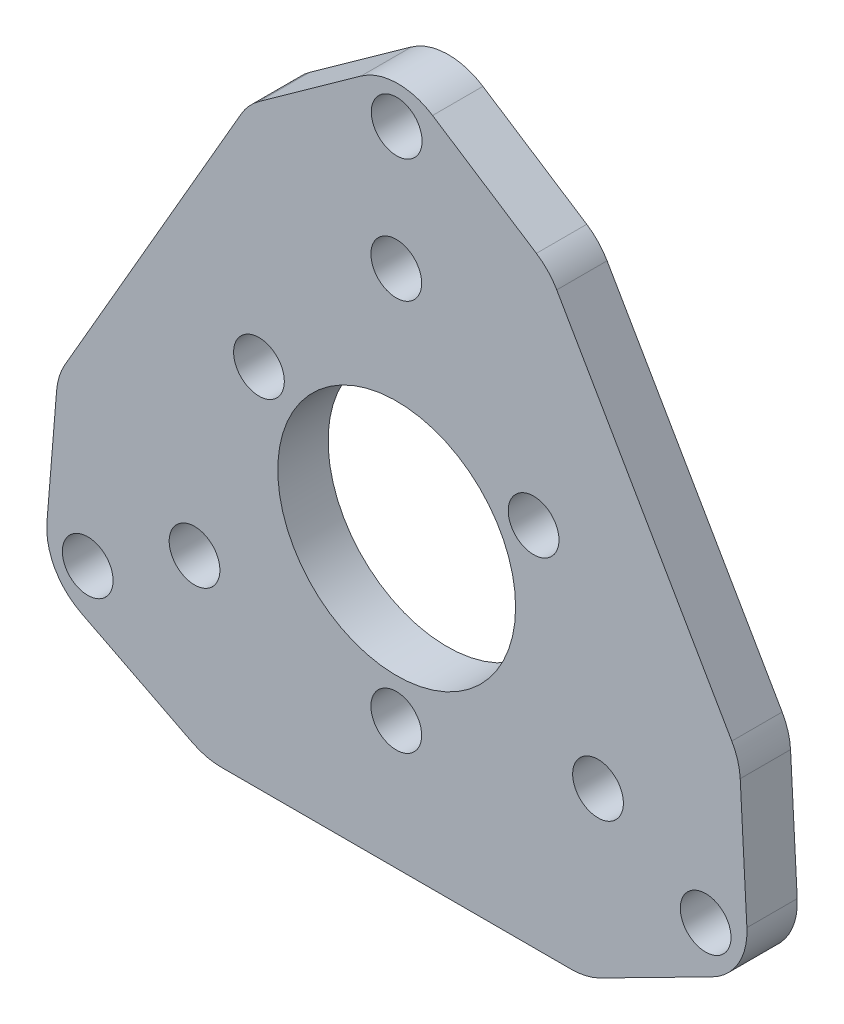
ISO-10303-21;
HEADER;
FILE_DESCRIPTION(('STEP AP214'),'2;1');
FILE_NAME('part.step','',(''),(''),'','','');
FILE_SCHEMA(('AUTOMOTIVE_DESIGN { 1 0 10303 214 1 1 1 1 }'));
ENDSEC;
DATA;
#1=APPLICATION_CONTEXT('core data for automotive mechanical design processes');
#2=APPLICATION_PROTOCOL_DEFINITION('international standard','automotive_design',2000,#1);
#3=PRODUCT_CONTEXT('',#1,'mechanical');
#4=PRODUCT('Part','Part','',(#3));
#5=PRODUCT_RELATED_PRODUCT_CATEGORY('part','',(#4));
#6=PRODUCT_DEFINITION_FORMATION('','',#4);
#7=PRODUCT_DEFINITION_CONTEXT('part definition',#1,'design');
#8=PRODUCT_DEFINITION('design','',#6,#7);
#9=PRODUCT_DEFINITION_SHAPE('','',#8);
#10=(LENGTH_UNIT() NAMED_UNIT(*) SI_UNIT(.MILLI.,.METRE.));
#11=(NAMED_UNIT(*) PLANE_ANGLE_UNIT() SI_UNIT($,.RADIAN.));
#12=(NAMED_UNIT(*) SI_UNIT($,.STERADIAN.) SOLID_ANGLE_UNIT());
#13=UNCERTAINTY_MEASURE_WITH_UNIT(LENGTH_MEASURE(1.E-05),#10,'distance_accuracy_value','');
#14=(GEOMETRIC_REPRESENTATION_CONTEXT(3) GLOBAL_UNCERTAINTY_ASSIGNED_CONTEXT((#13)) GLOBAL_UNIT_ASSIGNED_CONTEXT((#10,
#11,#12)) REPRESENTATION_CONTEXT('',''));
#15=CARTESIAN_POINT('',(0.,0.,0.));
#16=DIRECTION('',(0.,0.,1.));
#17=DIRECTION('',(1.,0.,0.));
#18=AXIS2_PLACEMENT_3D('',#15,#16,#17);
#19=CARTESIAN_POINT('',(24.2268431001887,37.2525078239316,3.175));
#20=DIRECTION('',(-0.545189451040315,-0.838312866699754,0.));
#21=DIRECTION('',(0.838312866699754,-0.545189451040315,0.));
#22=AXIS2_PLACEMENT_3D('',#19,#20,#21);
#23=PLANE('',#22);
#24=DIRECTION('',(-0.838312866699754,0.545189451040315,0.));
#25=VECTOR('',#24,1.);
#26=CARTESIAN_POINT('',(24.2268431001887,37.2525078239316,0.));
#27=LINE('',#26,#25);
#28=CARTESIAN_POINT('',(31.086717457556,32.7912484497055,0.));
#29=VERTEX_POINT('',#28);
#30=CARTESIAN_POINT('',(24.5392106724059,37.049362301556,0.));
#31=VERTEX_POINT('',#30);
#32=EDGE_CURVE('E216',#29,#31,#27,.T.);
#33=ORIENTED_EDGE('',*,*,#32,.T.);
#34=DIRECTION('',(0.,0.,-1.));
#35=VECTOR('',#34,1.);
#36=CARTESIAN_POINT('',(24.5392106724059,37.049362301556,3.175));
#37=LINE('',#36,#35);
#38=CARTESIAN_POINT('',(24.5392106724059,37.049362301556,3.175));
#39=VERTEX_POINT('',#38);
#40=EDGE_CURVE('E11',#39,#31,#37,.T.);
#41=ORIENTED_EDGE('',*,*,#40,.F.);
#42=DIRECTION('',(-0.838312866699754,0.545189451040315,0.));
#43=VECTOR('',#42,1.);
#44=CARTESIAN_POINT('',(24.2268431001887,37.2525078239316,3.175));
#45=LINE('',#44,#43);
#46=CARTESIAN_POINT('',(31.086717457556,32.7912484497055,3.175));
#47=VERTEX_POINT('',#46);
#48=EDGE_CURVE('E315',#47,#39,#45,.T.);
#49=ORIENTED_EDGE('',*,*,#48,.F.);
#50=DIRECTION('',(0.,0.,-1.));
#51=VECTOR('',#50,1.);
#52=CARTESIAN_POINT('',(31.086717457556,32.7912484497055,3.175));
#53=LINE('',#52,#51);
#54=EDGE_CURVE('E54',#47,#29,#53,.T.);
#55=ORIENTED_EDGE('',*,*,#54,.T.);
#56=EDGE_LOOP('',(#33,#41,#49,#55));
#57=FACE_BOUND('',#56,.T.);
#58=ADVANCED_FACE('F37',(#57),#23,.F.);
#59=CARTESIAN_POINT('',(22.3584528682446,33.696110834757,3.175));
#60=DIRECTION('',(0.,0.,-1.));
#61=DIRECTION('',(-1.,0.,0.));
#62=AXIS2_PLACEMENT_3D('',#59,#60,#61);
#63=CYLINDRICAL_SURFACE('',#62,4.);
#64=CARTESIAN_POINT('',(22.3584528682446,33.696110834757,0.));
#65=DIRECTION('',(0.,0.,1.));
#66=DIRECTION('',(1.,0.,0.));
#67=AXIS2_PLACEMENT_3D('',#64,#65,#66);
#68=CIRCLE('',#67,4.);
#69=CARTESIAN_POINT('',(20.0297433145625,36.9483580293272,0.));
#70=VERTEX_POINT('',#69);
#71=EDGE_CURVE('E218',#31,#70,#68,.T.);
#72=ORIENTED_EDGE('',*,*,#71,.T.);
#73=DIRECTION('',(0.,0.,-1.));
#74=VECTOR('',#73,1.);
#75=CARTESIAN_POINT('',(20.0297433145625,36.9483580293272,3.175));
#76=LINE('',#75,#74);
#77=CARTESIAN_POINT('',(20.0297433145625,36.9483580293272,3.175));
#78=VERTEX_POINT('',#77);
#79=EDGE_CURVE('E46',#78,#70,#76,.T.);
#80=ORIENTED_EDGE('',*,*,#79,.F.);
#81=CARTESIAN_POINT('',(22.3584528682446,33.696110834757,3.175));
#82=DIRECTION('',(0.,0.,1.));
#83=DIRECTION('',(1.,0.,0.));
#84=AXIS2_PLACEMENT_3D('',#81,#82,#83);
#85=CIRCLE('',#84,4.);
#86=EDGE_CURVE('E123',#39,#78,#85,.T.);
#87=ORIENTED_EDGE('',*,*,#86,.F.);
#88=ORIENTED_EDGE('',*,*,#40,.T.);
#89=EDGE_LOOP('',(#72,#80,#87,#88));
#90=FACE_BOUND('',#89,.T.);
#91=ADVANCED_FACE('F299',(#90),#63,.T.);
#92=CARTESIAN_POINT('',(-10.7006735197726,14.9444293641794,3.175));
#93=DIRECTION('',(-0.582177388420527,0.813061798642548,0.));
#94=DIRECTION('',(-0.813061798642548,-0.582177388420527,0.));
#95=AXIS2_PLACEMENT_3D('',#92,#93,#94);
#96=PLANE('',#95);
#97=DIRECTION('',(0.813061798642548,0.582177388420527,0.));
#98=VECTOR('',#97,1.);
#99=CARTESIAN_POINT('',(-10.7006735197726,14.9444293641794,0.));
#100=LINE('',#99,#98);
#101=CARTESIAN_POINT('',(13.6028361277302,32.3464937578807,0.));
#102=VERTEX_POINT('',#101);
#103=EDGE_CURVE('E221',#102,#70,#100,.T.);
#104=ORIENTED_EDGE('',*,*,#103,.F.);
#105=DIRECTION('',(0.,0.,-1.));
#106=VECTOR('',#105,1.);
#107=CARTESIAN_POINT('',(13.6028361277302,32.3464937578807,3.175));
#108=LINE('',#107,#106);
#109=CARTESIAN_POINT('',(13.6028361277302,32.3464937578807,3.175));
#110=VERTEX_POINT('',#109);
#111=EDGE_CURVE('E292',#110,#102,#108,.T.);
#112=ORIENTED_EDGE('',*,*,#111,.F.);
#113=DIRECTION('',(0.813061798642548,0.582177388420527,0.));
#114=VECTOR('',#113,1.);
#115=CARTESIAN_POINT('',(-10.7006735197726,14.9444293641794,3.175));
#116=LINE('',#115,#114);
#117=EDGE_CURVE('E298',#110,#78,#116,.T.);
#118=ORIENTED_EDGE('',*,*,#117,.T.);
#119=ORIENTED_EDGE('',*,*,#79,.T.);
#120=EDGE_LOOP('',(#104,#112,#118,#119));
#121=FACE_BOUND('',#120,.T.);
#122=ADVANCED_FACE('F296',(#121),#96,.T.);
#123=CARTESIAN_POINT('',(15.9315456814123,29.0942465633105,3.175));
#124=DIRECTION('',(0.,0.,-1.));
#125=DIRECTION('',(-1.,0.,0.));
#126=AXIS2_PLACEMENT_3D('',#123,#124,#125);
#127=CYLINDRICAL_SURFACE('',#126,4.);
#128=CARTESIAN_POINT('',(15.9315456814123,29.0942465633105,0.));
#129=DIRECTION('',(0.,0.,1.));
#130=DIRECTION('',(1.,0.,0.));
#131=AXIS2_PLACEMENT_3D('',#128,#129,#130);
#132=CIRCLE('',#131,4.);
#133=CARTESIAN_POINT('',(12.4674440662746,31.0942465633105,0.));
#134=VERTEX_POINT('',#133);
#135=EDGE_CURVE('E224',#134,#102,#132,.F.);
#136=ORIENTED_EDGE('',*,*,#135,.F.);
#137=DIRECTION('',(0.,0.,-1.));
#138=VECTOR('',#137,1.);
#139=CARTESIAN_POINT('',(12.4674440662746,31.0942465633105,3.175));
#140=LINE('',#139,#138);
#141=CARTESIAN_POINT('',(12.4674440662746,31.0942465633105,3.175));
#142=VERTEX_POINT('',#141);
#143=EDGE_CURVE('E290',#142,#134,#140,.T.);
#144=ORIENTED_EDGE('',*,*,#143,.F.);
#145=CARTESIAN_POINT('',(15.9315456814123,29.0942465633105,3.175));
#146=DIRECTION('',(0.,0.,1.));
#147=DIRECTION('',(1.,0.,0.));
#148=AXIS2_PLACEMENT_3D('',#145,#146,#147);
#149=CIRCLE('',#148,4.);
#150=EDGE_CURVE('E309',#142,#110,#149,.F.);
#151=ORIENTED_EDGE('',*,*,#150,.T.);
#152=ORIENTED_EDGE('',*,*,#111,.T.);
#153=EDGE_LOOP('',(#136,#144,#151,#152));
#154=FACE_BOUND('',#153,.T.);
#155=ADVANCED_FACE('F306',(#154),#127,.T.);
#156=CARTESIAN_POINT('',(-4.11362066797595,2.37499999999991,3.175));
#157=DIRECTION('',(-0.86602540378444,0.499999999999998,0.));
#158=DIRECTION('',(-0.499999999999998,-0.86602540378444,0.));
#159=AXIS2_PLACEMENT_3D('',#156,#157,#158);
#160=PLANE('',#159);
#161=DIRECTION('',(0.499999999999998,0.86602540378444,0.));
#162=VECTOR('',#161,1.);
#163=CARTESIAN_POINT('',(-4.11362066797595,2.37499999999991,0.));
#164=LINE('',#163,#162);
#165=CARTESIAN_POINT('',(1.34956059393549,11.8375075165888,0.));
#166=VERTEX_POINT('',#165);
#167=EDGE_CURVE('E227',#166,#134,#164,.T.);
#168=ORIENTED_EDGE('',*,*,#167,.F.);
#169=DIRECTION('',(0.,0.,-1.));
#170=VECTOR('',#169,1.);
#171=CARTESIAN_POINT('',(1.34956059393549,11.8375075165888,3.175));
#172=LINE('',#171,#170);
#173=CARTESIAN_POINT('',(1.34956059393549,11.8375075165888,3.175));
#174=VERTEX_POINT('',#173);
#175=EDGE_CURVE('E288',#174,#166,#172,.T.);
#176=ORIENTED_EDGE('',*,*,#175,.F.);
#177=DIRECTION('',(0.499999999999998,0.86602540378444,0.));
#178=VECTOR('',#177,1.);
#179=CARTESIAN_POINT('',(-4.11362066797595,2.37499999999991,3.175));
#180=LINE('',#179,#178);
#181=EDGE_CURVE('E313',#174,#142,#180,.T.);
#182=ORIENTED_EDGE('',*,*,#181,.T.);
#183=ORIENTED_EDGE('',*,*,#143,.T.);
#184=EDGE_LOOP('',(#168,#176,#182,#183));
#185=FACE_BOUND('',#184,.T.);
#186=ADVANCED_FACE('F689',(#185),#160,.T.);
#187=CARTESIAN_POINT('',(4.81366220907325,9.83750751658883,3.175));
#188=DIRECTION('',(0.,0.,-1.));
#189=DIRECTION('',(-1.,0.,0.));
#190=AXIS2_PLACEMENT_3D('',#187,#188,#189);
#191=CYLINDRICAL_SURFACE('',#190,4.);
#192=CARTESIAN_POINT('',(4.81366220907325,9.83750751658883,0.));
#193=DIRECTION('',(0.,0.,1.));
#194=DIRECTION('',(1.,0.,0.));
#195=AXIS2_PLACEMENT_3D('',#192,#193,#194);
#196=CIRCLE('',#195,4.);
#197=CARTESIAN_POINT('',(0.82683782126869,10.1619012600655,0.));
#198=VERTEX_POINT('',#197);
#199=EDGE_CURVE('E230',#198,#166,#196,.F.);
#200=ORIENTED_EDGE('',*,*,#199,.F.);
#201=DIRECTION('',(0.,0.,-1.));
#202=VECTOR('',#201,1.);
#203=CARTESIAN_POINT('',(0.82683782126869,10.1619012600655,3.175));
#204=LINE('',#203,#202);
#205=CARTESIAN_POINT('',(0.82683782126869,10.1619012600655,3.175));
#206=VERTEX_POINT('',#205);
#207=EDGE_CURVE('E286',#206,#198,#204,.T.);
#208=ORIENTED_EDGE('',*,*,#207,.F.);
#209=CARTESIAN_POINT('',(4.81366220907325,9.83750751658883,3.175));
#210=DIRECTION('',(0.,0.,1.));
#211=DIRECTION('',(1.,0.,0.));
#212=AXIS2_PLACEMENT_3D('',#209,#210,#211);
#213=CIRCLE('',#212,4.);
#214=EDGE_CURVE('E320',#206,#174,#213,.F.);
#215=ORIENTED_EDGE('',*,*,#214,.T.);
#216=ORIENTED_EDGE('',*,*,#175,.T.);
#217=EDGE_LOOP('',(#200,#208,#215,#216));
#218=FACE_BOUND('',#217,.T.);
#219=ADVANCED_FACE('F680',(#218),#191,.T.);
#220=CARTESIAN_POINT('',(0.,0.,3.175));
#221=DIRECTION('',(0.996706096951139,-0.0810984358691737,0.));
#222=DIRECTION('',(0.0810984358691737,0.996706096951139,0.));
#223=AXIS2_PLACEMENT_3D('',#220,#221,#222);
#224=PLANE('',#223);
#225=DIRECTION('',(-0.0810984358691737,-0.996706096951139,0.));
#226=VECTOR('',#225,1.);
#227=CARTESIAN_POINT('',(0.,0.,0.));
#228=LINE('',#227,#226);
#229=CARTESIAN_POINT('',(0.217529034956228,2.67344879196595,0.));
#230=VERTEX_POINT('',#229);
#231=EDGE_CURVE('E233',#198,#230,#228,.T.);
#232=ORIENTED_EDGE('',*,*,#231,.T.);
#233=DIRECTION('',(0.,0.,-1.));
#234=VECTOR('',#233,1.);
#235=CARTESIAN_POINT('',(0.217529034956228,2.67344879196595,3.175));
#236=LINE('',#235,#234);
#237=CARTESIAN_POINT('',(0.217529034956228,2.67344879196595,3.175));
#238=VERTEX_POINT('',#237);
#239=EDGE_CURVE('E284',#238,#230,#236,.T.);
#240=ORIENTED_EDGE('',*,*,#239,.F.);
#241=DIRECTION('',(-0.0810984358691737,-0.996706096951139,0.));
#242=VECTOR('',#241,1.);
#243=CARTESIAN_POINT('',(0.,0.,3.175));
#244=LINE('',#243,#242);
#245=EDGE_CURVE('E323',#206,#238,#244,.T.);
#246=ORIENTED_EDGE('',*,*,#245,.F.);
#247=ORIENTED_EDGE('',*,*,#207,.T.);
#248=EDGE_LOOP('',(#232,#240,#246,#247));
#249=FACE_BOUND('',#248,.T.);
#250=ADVANCED_FACE('F671',(#249),#224,.F.);
#251=CARTESIAN_POINT('',(4.20435342276078,2.34905504848923,3.175));
#252=DIRECTION('',(0.,0.,-1.));
#253=DIRECTION('',(-1.,0.,0.));
#254=AXIS2_PLACEMENT_3D('',#251,#252,#253);
#255=CYLINDRICAL_SURFACE('',#254,3.99999999999999);
#256=CARTESIAN_POINT('',(4.20435342276078,2.34905504848923,0.));
#257=DIRECTION('',(0.,0.,1.));
#258=DIRECTION('',(1.,0.,0.));
#259=AXIS2_PLACEMENT_3D('',#256,#257,#258);
#260=CIRCLE('',#259,3.99999999999999);
#261=CARTESIAN_POINT('',(2.39073136931604,-1.21616234281508,0.));
#262=VERTEX_POINT('',#261);
#263=EDGE_CURVE('E236',#262,#230,#260,.F.);
#264=ORIENTED_EDGE('',*,*,#263,.F.);
#265=DIRECTION('',(0.,0.,-1.));
#266=VECTOR('',#265,1.);
#267=CARTESIAN_POINT('',(2.39073136931604,-1.21616234281508,3.175));
#268=LINE('',#267,#266);
#269=CARTESIAN_POINT('',(2.39073136931604,-1.21616234281508,3.175));
#270=VERTEX_POINT('',#269);
#271=EDGE_CURVE('E282',#270,#262,#268,.T.);
#272=ORIENTED_EDGE('',*,*,#271,.F.);
#273=CARTESIAN_POINT('',(4.20435342276078,2.34905504848923,3.175));
#274=DIRECTION('',(0.,0.,1.));
#275=DIRECTION('',(1.,0.,0.));
#276=AXIS2_PLACEMENT_3D('',#273,#274,#275);
#277=CIRCLE('',#276,3.99999999999999);
#278=EDGE_CURVE('E325',#270,#238,#277,.F.);
#279=ORIENTED_EDGE('',*,*,#278,.T.);
#280=ORIENTED_EDGE('',*,*,#239,.T.);
#281=EDGE_LOOP('',(#264,#272,#279,#280));
#282=FACE_BOUND('',#281,.T.);
#283=ADVANCED_FACE('F662',(#282),#255,.T.);
#284=CARTESIAN_POINT('',(0.,0.,3.175));
#285=DIRECTION('',(0.453405513361187,0.891304347826082,0.));
#286=DIRECTION('',(-0.891304347826083,0.453405513361187,0.));
#287=AXIS2_PLACEMENT_3D('',#284,#285,#286);
#288=PLANE('',#287);
#289=DIRECTION('',(0.891304347826083,-0.453405513361187,0.));
#290=VECTOR('',#289,1.);
#291=CARTESIAN_POINT('',(0.,0.,0.));
#292=LINE('',#291,#290);
#293=CARTESIAN_POINT('',(9.39530454952662,-4.7793807949583,0.));
#294=VERTEX_POINT('',#293);
#295=EDGE_CURVE('E239',#262,#294,#292,.T.);
#296=ORIENTED_EDGE('',*,*,#295,.T.);
#297=DIRECTION('',(0.,0.,-1.));
#298=VECTOR('',#297,1.);
#299=CARTESIAN_POINT('',(9.39530454952662,-4.7793807949583,3.175));
#300=LINE('',#299,#298);
#301=CARTESIAN_POINT('',(9.39530454952662,-4.7793807949583,3.175));
#302=VERTEX_POINT('',#301);
#303=EDGE_CURVE('E280',#302,#294,#300,.T.);
#304=ORIENTED_EDGE('',*,*,#303,.F.);
#305=DIRECTION('',(0.891304347826083,-0.453405513361187,0.));
#306=VECTOR('',#305,1.);
#307=CARTESIAN_POINT('',(0.,0.,3.175));
#308=LINE('',#307,#306);
#309=EDGE_CURVE('E328',#270,#302,#308,.T.);
#310=ORIENTED_EDGE('',*,*,#309,.F.);
#311=ORIENTED_EDGE('',*,*,#271,.T.);
#312=EDGE_LOOP('',(#296,#304,#310,#311));
#313=FACE_BOUND('',#312,.T.);
#314=ADVANCED_FACE('F653',(#313),#288,.F.);
#315=CARTESIAN_POINT('',(11.2089266029714,-1.21416340365397,3.175));
#316=DIRECTION('',(0.,0.,-1.));
#317=DIRECTION('',(-1.,0.,0.));
#318=AXIS2_PLACEMENT_3D('',#315,#316,#317);
#319=CYLINDRICAL_SURFACE('',#318,4.);
#320=CARTESIAN_POINT('',(11.2089266029714,-1.21416340365397,0.));
#321=DIRECTION('',(0.,0.,1.));
#322=DIRECTION('',(1.,0.,0.));
#323=AXIS2_PLACEMENT_3D('',#320,#321,#322);
#324=CIRCLE('',#323,4.);
#325=CARTESIAN_POINT('',(11.2089266029714,-5.21416340365397,0.));
#326=VERTEX_POINT('',#325);
#327=EDGE_CURVE('E242',#326,#294,#324,.F.);
#328=ORIENTED_EDGE('',*,*,#327,.F.);
#329=DIRECTION('',(0.,0.,-1.));
#330=VECTOR('',#329,1.);
#331=CARTESIAN_POINT('',(11.2089266029714,-5.21416340365397,3.175));
#332=LINE('',#331,#330);
#333=CARTESIAN_POINT('',(11.2089266029714,-5.21416340365397,3.175));
#334=VERTEX_POINT('',#333);
#335=EDGE_CURVE('E278',#334,#326,#332,.T.);
#336=ORIENTED_EDGE('',*,*,#335,.F.);
#337=CARTESIAN_POINT('',(11.2089266029714,-1.21416340365397,3.175));
#338=DIRECTION('',(0.,0.,1.));
#339=DIRECTION('',(1.,0.,0.));
#340=AXIS2_PLACEMENT_3D('',#337,#338,#339);
#341=CIRCLE('',#340,4.);
#342=EDGE_CURVE('E330',#334,#302,#341,.F.);
#343=ORIENTED_EDGE('',*,*,#342,.T.);
#344=ORIENTED_EDGE('',*,*,#303,.T.);
#345=EDGE_LOOP('',(#328,#336,#343,#344));
#346=FACE_BOUND('',#345,.T.);
#347=ADVANCED_FACE('F644',(#346),#319,.T.);
#348=CARTESIAN_POINT('',(0.,-5.21416340365397,3.175));
#349=DIRECTION('',(0.,1.,0.));
#350=DIRECTION('',(-1.,0.,0.));
#351=AXIS2_PLACEMENT_3D('',#348,#349,#350);
#352=PLANE('',#351);
#353=DIRECTION('',(1.,0.,0.));
#354=VECTOR('',#353,1.);
#355=CARTESIAN_POINT('',(0.,-5.21416340365397,0.));
#356=LINE('',#355,#354);
#357=CARTESIAN_POINT('',(33.2910733970292,-5.21416340365397,0.));
#358=VERTEX_POINT('',#357);
#359=EDGE_CURVE('E245',#326,#358,#356,.T.);
#360=ORIENTED_EDGE('',*,*,#359,.T.);
#361=DIRECTION('',(0.,0.,-1.));
#362=VECTOR('',#361,1.);
#363=CARTESIAN_POINT('',(33.2910733970292,-5.21416340365397,3.175));
#364=LINE('',#363,#362);
#365=CARTESIAN_POINT('',(33.2910733970292,-5.21416340365397,3.175));
#366=VERTEX_POINT('',#365);
#367=EDGE_CURVE('E276',#366,#358,#364,.T.);
#368=ORIENTED_EDGE('',*,*,#367,.F.);
#369=DIRECTION('',(1.,0.,0.));
#370=VECTOR('',#369,1.);
#371=CARTESIAN_POINT('',(0.,-5.21416340365397,3.175));
#372=LINE('',#371,#370);
#373=EDGE_CURVE('E333',#334,#366,#372,.T.);
#374=ORIENTED_EDGE('',*,*,#373,.F.);
#375=ORIENTED_EDGE('',*,*,#335,.T.);
#376=EDGE_LOOP('',(#360,#368,#374,#375));
#377=FACE_BOUND('',#376,.T.);
#378=ADVANCED_FACE('F635',(#377),#352,.F.);
#379=CARTESIAN_POINT('',(33.2910733970292,-1.21416340365397,3.175));
#380=DIRECTION('',(0.,0.,-1.));
#381=DIRECTION('',(-1.,0.,0.));
#382=AXIS2_PLACEMENT_3D('',#379,#380,#381);
#383=CYLINDRICAL_SURFACE('',#382,4.);
#384=CARTESIAN_POINT('',(33.2910733970292,-1.21416340365397,0.));
#385=DIRECTION('',(0.,0.,1.));
#386=DIRECTION('',(1.,0.,0.));
#387=AXIS2_PLACEMENT_3D('',#384,#385,#386);
#388=CIRCLE('',#387,4.);
#389=CARTESIAN_POINT('',(35.104695450474,-4.77938079495826,0.));
#390=VERTEX_POINT('',#389);
#391=EDGE_CURVE('E248',#390,#358,#388,.F.);
#392=ORIENTED_EDGE('',*,*,#391,.F.);
#393=DIRECTION('',(0.,0.,-1.));
#394=VECTOR('',#393,1.);
#395=CARTESIAN_POINT('',(35.104695450474,-4.77938079495826,3.175));
#396=LINE('',#395,#394);
#397=CARTESIAN_POINT('',(35.104695450474,-4.77938079495826,3.175));
#398=VERTEX_POINT('',#397);
#399=EDGE_CURVE('E274',#398,#390,#396,.T.);
#400=ORIENTED_EDGE('',*,*,#399,.F.);
#401=CARTESIAN_POINT('',(33.2910733970292,-1.21416340365397,3.175));
#402=DIRECTION('',(0.,0.,1.));
#403=DIRECTION('',(1.,0.,0.));
#404=AXIS2_PLACEMENT_3D('',#401,#402,#403);
#405=CIRCLE('',#404,4.);
#406=EDGE_CURVE('E335',#398,#366,#405,.F.);
#407=ORIENTED_EDGE('',*,*,#406,.T.);
#408=ORIENTED_EDGE('',*,*,#367,.T.);
#409=EDGE_LOOP('',(#392,#400,#407,#408));
#410=FACE_BOUND('',#409,.T.);
#411=ADVANCED_FACE('F627',(#410),#383,.T.);
#412=CARTESIAN_POINT('',(9.14815689981217,-17.9834425897285,3.175));
#413=DIRECTION('',(-0.453405513361208,0.891304347826072,0.));
#414=DIRECTION('',(-0.891304347826072,-0.453405513361208,0.));
#415=AXIS2_PLACEMENT_3D('',#412,#413,#414);
#416=PLANE('',#415);
#417=DIRECTION('',(0.891304347826072,0.453405513361208,0.));
#418=VECTOR('',#417,1.);
#419=CARTESIAN_POINT('',(9.14815689981217,-17.9834425897285,0.));
#420=LINE('',#419,#418);
#421=CARTESIAN_POINT('',(42.1813920081454,-1.17947326229733,0.));
#422=VERTEX_POINT('',#421);
#423=EDGE_CURVE('E251',#390,#422,#420,.T.);
#424=ORIENTED_EDGE('',*,*,#423,.T.);
#425=DIRECTION('',(0.,0.,-1.));
#426=VECTOR('',#425,1.);
#427=CARTESIAN_POINT('',(42.1813920081454,-1.17947326229733,3.175));
#428=LINE('',#427,#426);
#429=CARTESIAN_POINT('',(42.1813920081454,-1.17947326229733,3.175));
#430=VERTEX_POINT('',#429);
#431=EDGE_CURVE('E272',#430,#422,#428,.T.);
#432=ORIENTED_EDGE('',*,*,#431,.F.);
#433=DIRECTION('',(0.891304347826072,0.453405513361208,0.));
#434=VECTOR('',#433,1.);
#435=CARTESIAN_POINT('',(9.14815689981217,-17.9834425897285,3.175));
#436=LINE('',#435,#434);
#437=EDGE_CURVE('E338',#398,#430,#436,.T.);
#438=ORIENTED_EDGE('',*,*,#437,.F.);
#439=ORIENTED_EDGE('',*,*,#399,.T.);
#440=EDGE_LOOP('',(#424,#432,#438,#439));
#441=FACE_BOUND('',#440,.T.);
#442=ADVANCED_FACE('F347',(#441),#416,.F.);
#443=CARTESIAN_POINT('',(40.3677699547006,2.385744129007,3.175));
#444=DIRECTION('',(0.,0.,-1.));
#445=DIRECTION('',(-1.,0.,0.));
#446=AXIS2_PLACEMENT_3D('',#443,#444,#445);
#447=CYLINDRICAL_SURFACE('',#446,4.00000000000002);
#448=CARTESIAN_POINT('',(40.3677699547006,2.385744129007,0.));
#449=DIRECTION('',(0.,0.,1.));
#450=DIRECTION('',(1.,0.,0.));
#451=AXIS2_PLACEMENT_3D('',#448,#449,#450);
#452=CIRCLE('',#451,4.00000000000002);
#453=CARTESIAN_POINT('',(44.3621498123066,2.59771005351232,0.));
#454=VERTEX_POINT('',#453);
#455=EDGE_CURVE('E254',#454,#422,#452,.F.);
#456=ORIENTED_EDGE('',*,*,#455,.F.);
#457=DIRECTION('',(0.,0.,-1.));
#458=VECTOR('',#457,1.);
#459=CARTESIAN_POINT('',(44.3621498123066,2.59771005351232,3.175));
#460=LINE('',#459,#458);
#461=CARTESIAN_POINT('',(44.3621498123066,2.59771005351232,3.175));
#462=VERTEX_POINT('',#461);
#463=EDGE_CURVE('E270',#462,#454,#460,.T.);
#464=ORIENTED_EDGE('',*,*,#463,.F.);
#465=CARTESIAN_POINT('',(40.3677699547006,2.385744129007,3.175));
#466=DIRECTION('',(0.,0.,1.));
#467=DIRECTION('',(1.,0.,0.));
#468=AXIS2_PLACEMENT_3D('',#465,#466,#467);
#469=CIRCLE('',#468,4.00000000000002);
#470=EDGE_CURVE('E192',#462,#430,#469,.F.);
#471=ORIENTED_EDGE('',*,*,#470,.T.);
#472=ORIENTED_EDGE('',*,*,#431,.T.);
#473=EDGE_LOOP('',(#456,#464,#471,#472));
#474=FACE_BOUND('',#473,.T.);
#475=ADVANCED_FACE('F342',(#474),#447,.T.);
#476=CARTESIAN_POINT('',(44.3750396802976,2.35480766629788,3.175));
#477=DIRECTION('',(-0.998594964401502,-0.0529914811263407,0.));
#478=DIRECTION('',(0.0529914811263407,-0.998594964401502,0.));
#479=AXIS2_PLACEMENT_3D('',#476,#477,#478);
#480=PLANE('',#479);
#481=DIRECTION('',(-0.0529914811263407,0.998594964401502,0.));
#482=VECTOR('',#481,1.);
#483=CARTESIAN_POINT('',(44.3750396802976,2.35480766629788,0.));
#484=LINE('',#483,#482);
#485=CARTESIAN_POINT('',(43.9414129080299,10.5262628136601,0.));
#486=VERTEX_POINT('',#485);
#487=EDGE_CURVE('E257',#454,#486,#484,.T.);
#488=ORIENTED_EDGE('',*,*,#487,.T.);
#489=DIRECTION('',(0.,0.,-1.));
#490=VECTOR('',#489,1.);
#491=CARTESIAN_POINT('',(43.9414129080299,10.5262628136601,3.175));
#492=LINE('',#491,#490);
#493=CARTESIAN_POINT('',(43.9414129080299,10.5262628136601,3.175));
#494=VERTEX_POINT('',#493);
#495=EDGE_CURVE('E178',#494,#486,#492,.T.);
#496=ORIENTED_EDGE('',*,*,#495,.F.);
#497=DIRECTION('',(-0.0529914811263407,0.998594964401502,0.));
#498=VECTOR('',#497,1.);
#499=CARTESIAN_POINT('',(44.3750396802976,2.35480766629788,3.175));
#500=LINE('',#499,#498);
#501=EDGE_CURVE('E189',#462,#494,#500,.T.);
#502=ORIENTED_EDGE('',*,*,#501,.F.);
#503=ORIENTED_EDGE('',*,*,#463,.T.);
#504=EDGE_LOOP('',(#488,#496,#502,#503));
#505=FACE_BOUND('',#504,.T.);
#506=ADVANCED_FACE('F352',(#505),#480,.F.);
#507=CARTESIAN_POINT('',(39.9470330504239,10.3142968891547,3.175));
#508=DIRECTION('',(0.,0.,-1.));
#509=DIRECTION('',(-1.,0.,0.));
#510=AXIS2_PLACEMENT_3D('',#507,#508,#509);
#511=CYLINDRICAL_SURFACE('',#510,4.);
#512=CARTESIAN_POINT('',(39.9470330504239,10.3142968891547,0.));
#513=DIRECTION('',(0.,0.,1.));
#514=DIRECTION('',(1.,0.,0.));
#515=AXIS2_PLACEMENT_3D('',#512,#513,#514);
#516=CIRCLE('',#515,4.);
#517=CARTESIAN_POINT('',(43.4111346655617,12.3142968891547,0.));
#518=VERTEX_POINT('',#517);
#519=EDGE_CURVE('E175',#518,#486,#516,.F.);
#520=ORIENTED_EDGE('',*,*,#519,.F.);
#521=DIRECTION('',(0.,0.,-1.));
#522=VECTOR('',#521,1.);
#523=CARTESIAN_POINT('',(43.4111346655617,12.3142968891547,3.175));
#524=LINE('',#523,#522);
#525=CARTESIAN_POINT('',(43.4111346655617,12.3142968891547,3.175));
#526=VERTEX_POINT('',#525);
#527=EDGE_CURVE('E169',#526,#518,#524,.T.);
#528=ORIENTED_EDGE('',*,*,#527,.F.);
#529=CARTESIAN_POINT('',(39.9470330504239,10.3142968891547,3.175));
#530=DIRECTION('',(0.,0.,1.));
#531=DIRECTION('',(1.,0.,0.));
#532=AXIS2_PLACEMENT_3D('',#529,#530,#531);
#533=CIRCLE('',#532,4.);
#534=EDGE_CURVE('E173',#526,#494,#533,.F.);
#535=ORIENTED_EDGE('',*,*,#534,.T.);
#536=ORIENTED_EDGE('',*,*,#495,.T.);
#537=EDGE_LOOP('',(#520,#528,#535,#536));
#538=FACE_BOUND('',#537,.T.);
#539=ADVANCED_FACE('F171',(#538),#511,.T.);
#540=CARTESIAN_POINT('',(37.8905979670472,21.8761469360304,3.175));
#541=DIRECTION('',(-0.86602540378444,-0.499999999999997,0.));
#542=DIRECTION('',(0.499999999999997,-0.86602540378444,0.));
#543=AXIS2_PLACEMENT_3D('',#540,#541,#542);
#544=PLANE('',#543);
#545=DIRECTION('',(-0.499999999999997,0.86602540378444,0.));
#546=VECTOR('',#545,1.);
#547=CARTESIAN_POINT('',(37.8905979670472,21.8761469360304,0.));
#548=LINE('',#547,#546);
#549=CARTESIAN_POINT('',(32.3700612685325,31.4379969829065,0.));
#550=VERTEX_POINT('',#549);
#551=EDGE_CURVE('E261',#518,#550,#548,.T.);
#552=ORIENTED_EDGE('',*,*,#551,.T.);
#553=DIRECTION('',(0.,0.,-1.));
#554=VECTOR('',#553,1.);
#555=CARTESIAN_POINT('',(32.3700612685325,31.4379969829065,3.175));
#556=LINE('',#555,#554);
#557=CARTESIAN_POINT('',(32.3700612685325,31.4379969829065,3.175));
#558=VERTEX_POINT('',#557);
#559=EDGE_CURVE('E111',#558,#550,#556,.T.);
#560=ORIENTED_EDGE('',*,*,#559,.F.);
#561=DIRECTION('',(-0.499999999999997,0.86602540378444,0.));
#562=VECTOR('',#561,1.);
#563=CARTESIAN_POINT('',(37.8905979670472,21.8761469360304,3.175));
#564=LINE('',#563,#562);
#565=EDGE_CURVE('E180',#526,#558,#564,.T.);
#566=ORIENTED_EDGE('',*,*,#565,.F.);
#567=ORIENTED_EDGE('',*,*,#527,.T.);
#568=EDGE_LOOP('',(#552,#560,#566,#567));
#569=FACE_BOUND('',#568,.T.);
#570=ADVANCED_FACE('F181',(#569),#544,.F.);
#571=CARTESIAN_POINT('',(13.5897459621547,17.8460434894692,3.175));
#572=DIRECTION('',(0.,0.,-1.));
#573=DIRECTION('',(-1.,0.,0.));
#574=AXIS2_PLACEMENT_3D('',#571,#572,#573);
#575=CYLINDRICAL_SURFACE('',#574,1.60000000000057);
#576=CARTESIAN_POINT('',(13.5897459621547,17.8460434894692,3.175));
#577=DIRECTION('',(0.,0.,1.));
#578=DIRECTION('',(1.,0.,0.));
#579=AXIS2_PLACEMENT_3D('',#576,#577,#578);
#580=CIRCLE('',#579,1.60000000000057);
#581=CARTESIAN_POINT('',(15.1897459621552,17.8460434894692,3.175));
#582=VERTEX_POINT('',#581);
#583=EDGE_CURVE('E561',#582,#582,#580,.T.);
#584=ORIENTED_EDGE('',*,*,#583,.T.);
#585=EDGE_LOOP('',(#584));
#586=FACE_BOUND('',#585,.T.);
#587=CARTESIAN_POINT('',(13.5897459621547,17.8460434894692,0.));
#588=DIRECTION('',(0.,0.,1.));
#589=DIRECTION('',(1.,0.,0.));
#590=AXIS2_PLACEMENT_3D('',#587,#588,#589);
#591=CIRCLE('',#590,1.60000000000057);
#592=CARTESIAN_POINT('',(15.1897459621552,17.8460434894692,0.));
#593=VERTEX_POINT('',#592);
#594=EDGE_CURVE('E213',#593,#593,#591,.T.);
#595=ORIENTED_EDGE('',*,*,#594,.F.);
#596=EDGE_LOOP('',(#595));
#597=FACE_BOUND('',#596,.T.);
#598=ADVANCED_FACE('F369',(#586,#597),#575,.F.);
#599=CARTESIAN_POINT('',(9.52627944163036,5.4999999999991,3.175));
#600=DIRECTION('',(0.,0.,-1.));
#601=DIRECTION('',(-1.,0.,0.));
#602=AXIS2_PLACEMENT_3D('',#599,#600,#601);
#603=CYLINDRICAL_SURFACE('',#602,1.59999999999933);
#604=CARTESIAN_POINT('',(9.52627944163036,5.4999999999991,3.175));
#605=DIRECTION('',(0.,0.,1.));
#606=DIRECTION('',(1.,0.,0.));
#607=AXIS2_PLACEMENT_3D('',#604,#605,#606);
#608=CIRCLE('',#607,1.59999999999933);
#609=CARTESIAN_POINT('',(11.1262794416297,5.4999999999991,3.175));
#610=VERTEX_POINT('',#609);
#611=EDGE_CURVE('E558',#610,#610,#608,.T.);
#612=ORIENTED_EDGE('',*,*,#611,.T.);
#613=EDGE_LOOP('',(#612));
#614=FACE_BOUND('',#613,.T.);
#615=CARTESIAN_POINT('',(9.52627944163036,5.4999999999991,0.));
#616=DIRECTION('',(0.,0.,1.));
#617=DIRECTION('',(1.,0.,0.));
#618=AXIS2_PLACEMENT_3D('',#615,#616,#617);
#619=CIRCLE('',#618,1.59999999999933);
#620=CARTESIAN_POINT('',(11.1262794416297,5.4999999999991,0.));
#621=VERTEX_POINT('',#620);
#622=EDGE_CURVE('E210',#621,#621,#619,.T.);
#623=ORIENTED_EDGE('',*,*,#622,.F.);
#624=EDGE_LOOP('',(#623));
#625=FACE_BOUND('',#624,.T.);
#626=ADVANCED_FACE('F372',(#614,#625),#603,.F.);
#627=CARTESIAN_POINT('',(34.9737205583721,5.50000000000108,3.175));
#628=DIRECTION('',(0.,0.,-1.));
#629=DIRECTION('',(-1.,0.,0.));
#630=AXIS2_PLACEMENT_3D('',#627,#628,#629);
#631=CYLINDRICAL_SURFACE('',#630,1.60000000000013);
#632=CARTESIAN_POINT('',(34.9737205583721,5.50000000000108,3.175));
#633=DIRECTION('',(0.,0.,1.));
#634=DIRECTION('',(1.,0.,0.));
#635=AXIS2_PLACEMENT_3D('',#632,#633,#634);
#636=CIRCLE('',#635,1.60000000000013);
#637=CARTESIAN_POINT('',(36.5737205583722,5.50000000000108,3.175));
#638=VERTEX_POINT('',#637);
#639=EDGE_CURVE('E555',#638,#638,#636,.T.);
#640=ORIENTED_EDGE('',*,*,#639,.T.);
#641=EDGE_LOOP('',(#640));
#642=FACE_BOUND('',#641,.T.);
#643=CARTESIAN_POINT('',(34.9737205583721,5.50000000000108,0.));
#644=DIRECTION('',(0.,0.,1.));
#645=DIRECTION('',(1.,0.,0.));
#646=AXIS2_PLACEMENT_3D('',#643,#644,#645);
#647=CIRCLE('',#646,1.60000000000013);
#648=CARTESIAN_POINT('',(36.5737205583722,5.50000000000108,0.));
#649=VERTEX_POINT('',#648);
#650=EDGE_CURVE('E207',#649,#649,#647,.T.);
#651=ORIENTED_EDGE('',*,*,#650,.F.);
#652=EDGE_LOOP('',(#651));
#653=FACE_BOUND('',#652,.T.);
#654=ADVANCED_FACE('F376',(#642,#653),#631,.F.);
#655=CARTESIAN_POINT('',(30.9102540378434,17.8460434894696,3.175));
#656=DIRECTION('',(0.,0.,-1.));
#657=DIRECTION('',(-1.,0.,0.));
#658=AXIS2_PLACEMENT_3D('',#655,#656,#657);
#659=CYLINDRICAL_SURFACE('',#658,1.60000000000058);
#660=CARTESIAN_POINT('',(30.9102540378434,17.8460434894696,3.175));
#661=DIRECTION('',(0.,0.,1.));
#662=DIRECTION('',(1.,0.,0.));
#663=AXIS2_PLACEMENT_3D('',#660,#661,#662);
#664=CIRCLE('',#663,1.60000000000058);
#665=CARTESIAN_POINT('',(32.510254037844,17.8460434894696,3.175));
#666=VERTEX_POINT('',#665);
#667=EDGE_CURVE('E552',#666,#666,#664,.T.);
#668=ORIENTED_EDGE('',*,*,#667,.T.);
#669=EDGE_LOOP('',(#668));
#670=FACE_BOUND('',#669,.T.);
#671=CARTESIAN_POINT('',(30.9102540378434,17.8460434894696,0.));
#672=DIRECTION('',(0.,0.,1.));
#673=DIRECTION('',(1.,0.,0.));
#674=AXIS2_PLACEMENT_3D('',#671,#672,#673);
#675=CIRCLE('',#674,1.60000000000058);
#676=CARTESIAN_POINT('',(32.510254037844,17.8460434894696,0.));
#677=VERTEX_POINT('',#676);
#678=EDGE_CURVE('E204',#677,#677,#675,.T.);
#679=ORIENTED_EDGE('',*,*,#678,.F.);
#680=EDGE_LOOP('',(#679));
#681=FACE_BOUND('',#680,.T.);
#682=ADVANCED_FACE('F380',(#670,#681),#659,.F.);
#683=CARTESIAN_POINT('',(22.2499999999995,27.538130468407,3.175));
#684=DIRECTION('',(0.,0.,-1.));
#685=DIRECTION('',(-1.,0.,0.));
#686=AXIS2_PLACEMENT_3D('',#683,#684,#685);
#687=CYLINDRICAL_SURFACE('',#686,1.60000000000047);
#688=CARTESIAN_POINT('',(22.2499999999995,27.538130468407,3.175));
#689=DIRECTION('',(0.,0.,1.));
#690=DIRECTION('',(1.,0.,0.));
#691=AXIS2_PLACEMENT_3D('',#688,#689,#690);
#692=CIRCLE('',#691,1.60000000000047);
#693=CARTESIAN_POINT('',(23.85,27.538130468407,3.175));
#694=VERTEX_POINT('',#693);
#695=EDGE_CURVE('E395',#694,#694,#692,.T.);
#696=ORIENTED_EDGE('',*,*,#695,.T.);
#697=EDGE_LOOP('',(#696));
#698=FACE_BOUND('',#697,.T.);
#699=CARTESIAN_POINT('',(22.2499999999995,27.538130468407,0.));
#700=DIRECTION('',(0.,0.,1.));
#701=DIRECTION('',(1.,0.,0.));
#702=AXIS2_PLACEMENT_3D('',#699,#700,#701);
#703=CIRCLE('',#702,1.60000000000047);
#704=CARTESIAN_POINT('',(23.85,27.538130468407,0.));
#705=VERTEX_POINT('',#704);
#706=EDGE_CURVE('E200',#705,#705,#703,.T.);
#707=ORIENTED_EDGE('',*,*,#706,.F.);
#708=EDGE_LOOP('',(#707));
#709=FACE_BOUND('',#708,.T.);
#710=ADVANCED_FACE('F383',(#698,#709),#687,.F.);
#711=CARTESIAN_POINT('',(22.2500000000002,2.84604348946933,3.175));
#712=DIRECTION('',(0.,0.,-1.));
#713=DIRECTION('',(-1.,0.,0.));
#714=AXIS2_PLACEMENT_3D('',#711,#712,#713);
#715=CYLINDRICAL_SURFACE('',#714,1.60000000000057);
#716=CARTESIAN_POINT('',(22.2500000000002,2.84604348946933,3.175));
#717=DIRECTION('',(0.,0.,1.));
#718=DIRECTION('',(1.,0.,0.));
#719=AXIS2_PLACEMENT_3D('',#716,#717,#718);
#720=CIRCLE('',#719,1.60000000000057);
#721=CARTESIAN_POINT('',(23.8500000000008,2.84604348946933,3.175));
#722=VERTEX_POINT('',#721);
#723=EDGE_CURVE('E266',#722,#722,#720,.T.);
#724=ORIENTED_EDGE('',*,*,#723,.T.);
#725=EDGE_LOOP('',(#724));
#726=FACE_BOUND('',#725,.T.);
#727=CARTESIAN_POINT('',(22.2500000000002,2.84604348946933,0.));
#728=DIRECTION('',(0.,0.,1.));
#729=DIRECTION('',(1.,0.,0.));
#730=AXIS2_PLACEMENT_3D('',#727,#728,#729);
#731=CIRCLE('',#730,1.60000000000057);
#732=CARTESIAN_POINT('',(23.8500000000008,2.84604348946933,0.));
#733=VERTEX_POINT('',#732);
#734=EDGE_CURVE('E197',#733,#733,#731,.T.);
#735=ORIENTED_EDGE('',*,*,#734,.F.);
#736=EDGE_LOOP('',(#735));
#737=FACE_BOUND('',#736,.T.);
#738=ADVANCED_FACE('F39',(#726,#737),#715,.F.);
#739=CARTESIAN_POINT('',(28.9059596533948,29.4379969829065,3.175));
#740=DIRECTION('',(0.,0.,-1.));
#741=DIRECTION('',(-1.,0.,0.));
#742=AXIS2_PLACEMENT_3D('',#739,#740,#741);
#743=CYLINDRICAL_SURFACE('',#742,4.);
#744=CARTESIAN_POINT('',(28.9059596533948,29.4379969829065,0.));
#745=DIRECTION('',(0.,0.,1.));
#746=DIRECTION('',(1.,0.,0.));
#747=AXIS2_PLACEMENT_3D('',#744,#745,#746);
#748=CIRCLE('',#747,4.);
#749=EDGE_CURVE('E263',#29,#550,#748,.F.);
#750=ORIENTED_EDGE('',*,*,#749,.F.);
#751=ORIENTED_EDGE('',*,*,#54,.F.);
#752=CARTESIAN_POINT('',(28.9059596533948,29.4379969829065,3.175));
#753=DIRECTION('',(0.,0.,1.));
#754=DIRECTION('',(1.,0.,0.));
#755=AXIS2_PLACEMENT_3D('',#752,#753,#754);
#756=CIRCLE('',#755,4.);
#757=EDGE_CURVE('E184',#47,#558,#756,.F.);
#758=ORIENTED_EDGE('',*,*,#757,.T.);
#759=ORIENTED_EDGE('',*,*,#559,.T.);
#760=EDGE_LOOP('',(#750,#751,#758,#759));
#761=FACE_BOUND('',#760,.T.);
#762=ADVANCED_FACE('F390',(#761),#743,.T.);
#763=CARTESIAN_POINT('',(0.,0.,3.175));
#764=DIRECTION('',(0.,0.,1.));
#765=DIRECTION('',(1.,0.,0.));
#766=AXIS2_PLACEMENT_3D('',#763,#764,#765);
#767=PLANE('',#766);
#768=CARTESIAN_POINT('',(2.78989182585913,1.56383014544503,3.175));
#769=DIRECTION('',(0.,0.,1.));
#770=DIRECTION('',(1.,0.,0.));
#771=AXIS2_PLACEMENT_3D('',#768,#769,#770);
#772=CIRCLE('',#771,1.6);
#773=CARTESIAN_POINT('',(4.38989182585913,1.56383014544503,3.175));
#774=VERTEX_POINT('',#773);
#775=EDGE_CURVE('E537',#774,#774,#772,.T.);
#776=ORIENTED_EDGE('',*,*,#775,.F.);
#777=EDGE_LOOP('',(#776));
#778=FACE_BOUND('',#777,.T.);
#779=CARTESIAN_POINT('',(41.7610349961589,1.56383014544641,3.175));
#780=DIRECTION('',(0.,0.,1.));
#781=DIRECTION('',(1.,0.,0.));
#782=AXIS2_PLACEMENT_3D('',#779,#780,#781);
#783=CIRCLE('',#782,1.6);
#784=CARTESIAN_POINT('',(43.3610349961589,1.56383014544641,3.175));
#785=VERTEX_POINT('',#784);
#786=EDGE_CURVE('E539',#785,#785,#783,.T.);
#787=ORIENTED_EDGE('',*,*,#786,.F.);
#788=EDGE_LOOP('',(#787));
#789=FACE_BOUND('',#788,.T.);
#790=CARTESIAN_POINT('',(22.2754634110077,35.3138301454457,3.175));
#791=DIRECTION('',(0.,0.,1.));
#792=DIRECTION('',(1.,0.,0.));
#793=AXIS2_PLACEMENT_3D('',#790,#791,#792);
#794=CIRCLE('',#793,1.6);
#795=CARTESIAN_POINT('',(23.8754634110077,35.3138301454457,3.175));
#796=VERTEX_POINT('',#795);
#797=EDGE_CURVE('E580',#796,#796,#794,.T.);
#798=ORIENTED_EDGE('',*,*,#797,.F.);
#799=EDGE_LOOP('',(#798));
#800=FACE_BOUND('',#799,.T.);
#801=CARTESIAN_POINT('',(22.2754634110077,12.8138301454457,3.175));
#802=DIRECTION('',(0.,0.,1.));
#803=DIRECTION('',(1.,0.,0.));
#804=AXIS2_PLACEMENT_3D('',#801,#802,#803);
#805=CIRCLE('',#804,7.5);
#806=CARTESIAN_POINT('',(29.7754634110077,12.8138301454457,3.175));
#807=VERTEX_POINT('',#806);
#808=EDGE_CURVE('E545',#807,#807,#805,.T.);
#809=ORIENTED_EDGE('',*,*,#808,.F.);
#810=EDGE_LOOP('',(#809));
#811=FACE_BOUND('',#810,.T.);
#812=ORIENTED_EDGE('',*,*,#723,.F.);
#813=EDGE_LOOP('',(#812));
#814=FACE_BOUND('',#813,.T.);
#815=ORIENTED_EDGE('',*,*,#695,.F.);
#816=EDGE_LOOP('',(#815));
#817=FACE_BOUND('',#816,.T.);
#818=ORIENTED_EDGE('',*,*,#667,.F.);
#819=EDGE_LOOP('',(#818));
#820=FACE_BOUND('',#819,.T.);
#821=ORIENTED_EDGE('',*,*,#639,.F.);
#822=EDGE_LOOP('',(#821));
#823=FACE_BOUND('',#822,.T.);
#824=ORIENTED_EDGE('',*,*,#611,.F.);
#825=EDGE_LOOP('',(#824));
#826=FACE_BOUND('',#825,.T.);
#827=ORIENTED_EDGE('',*,*,#583,.F.);
#828=EDGE_LOOP('',(#827));
#829=FACE_BOUND('',#828,.T.);
#830=ORIENTED_EDGE('',*,*,#48,.T.);
#831=ORIENTED_EDGE('',*,*,#86,.T.);
#832=ORIENTED_EDGE('',*,*,#117,.F.);
#833=ORIENTED_EDGE('',*,*,#150,.F.);
#834=ORIENTED_EDGE('',*,*,#181,.F.);
#835=ORIENTED_EDGE('',*,*,#214,.F.);
#836=ORIENTED_EDGE('',*,*,#245,.T.);
#837=ORIENTED_EDGE('',*,*,#278,.F.);
#838=ORIENTED_EDGE('',*,*,#309,.T.);
#839=ORIENTED_EDGE('',*,*,#342,.F.);
#840=ORIENTED_EDGE('',*,*,#373,.T.);
#841=ORIENTED_EDGE('',*,*,#406,.F.);
#842=ORIENTED_EDGE('',*,*,#437,.T.);
#843=ORIENTED_EDGE('',*,*,#470,.F.);
#844=ORIENTED_EDGE('',*,*,#501,.T.);
#845=ORIENTED_EDGE('',*,*,#534,.F.);
#846=ORIENTED_EDGE('',*,*,#565,.T.);
#847=ORIENTED_EDGE('',*,*,#757,.F.);
#848=EDGE_LOOP('',(#830,#831,#832,#833,#834,#835,#836,#837,#838,#839,#840,#841,#842,#843,#844,
#845,#846,#847));
#849=FACE_BOUND('',#848,.T.);
#850=ADVANCED_FACE('F186',(#778,#789,#800,#811,#814,#817,#820,#823,#826,#829,#849),#767,.T.);
#851=CARTESIAN_POINT('',(0.,0.,0.));
#852=DIRECTION('',(0.,0.,1.));
#853=DIRECTION('',(1.,0.,0.));
#854=AXIS2_PLACEMENT_3D('',#851,#852,#853);
#855=PLANE('',#854);
#856=CARTESIAN_POINT('',(2.78989182585913,1.56383014544503,0.));
#857=DIRECTION('',(0.,0.,1.));
#858=DIRECTION('',(1.,0.,0.));
#859=AXIS2_PLACEMENT_3D('',#856,#857,#858);
#860=CIRCLE('',#859,1.6);
#861=CARTESIAN_POINT('',(4.38989182585913,1.56383014544503,0.));
#862=VERTEX_POINT('',#861);
#863=EDGE_CURVE('E534',#862,#862,#860,.T.);
#864=ORIENTED_EDGE('',*,*,#863,.T.);
#865=EDGE_LOOP('',(#864));
#866=FACE_BOUND('',#865,.T.);
#867=CARTESIAN_POINT('',(41.7610349961589,1.56383014544641,0.));
#868=DIRECTION('',(0.,0.,1.));
#869=DIRECTION('',(1.,0.,0.));
#870=AXIS2_PLACEMENT_3D('',#867,#868,#869);
#871=CIRCLE('',#870,1.6);
#872=CARTESIAN_POINT('',(43.3610349961589,1.56383014544641,0.));
#873=VERTEX_POINT('',#872);
#874=EDGE_CURVE('E585',#873,#873,#871,.T.);
#875=ORIENTED_EDGE('',*,*,#874,.T.);
#876=EDGE_LOOP('',(#875));
#877=FACE_BOUND('',#876,.T.);
#878=CARTESIAN_POINT('',(22.2754634110077,35.3138301454457,0.));
#879=DIRECTION('',(0.,0.,1.));
#880=DIRECTION('',(1.,0.,0.));
#881=AXIS2_PLACEMENT_3D('',#878,#879,#880);
#882=CIRCLE('',#881,1.6);
#883=CARTESIAN_POINT('',(23.8754634110077,35.3138301454457,0.));
#884=VERTEX_POINT('',#883);
#885=EDGE_CURVE('E548',#884,#884,#882,.T.);
#886=ORIENTED_EDGE('',*,*,#885,.T.);
#887=EDGE_LOOP('',(#886));
#888=FACE_BOUND('',#887,.T.);
#889=CARTESIAN_POINT('',(22.2754634110077,12.8138301454457,0.));
#890=DIRECTION('',(0.,0.,1.));
#891=DIRECTION('',(1.,0.,0.));
#892=AXIS2_PLACEMENT_3D('',#889,#890,#891);
#893=CIRCLE('',#892,7.5);
#894=CARTESIAN_POINT('',(29.7754634110077,12.8138301454457,0.));
#895=VERTEX_POINT('',#894);
#896=EDGE_CURVE('E201',#895,#895,#893,.T.);
#897=ORIENTED_EDGE('',*,*,#896,.T.);
#898=EDGE_LOOP('',(#897));
#899=FACE_BOUND('',#898,.T.);
#900=ORIENTED_EDGE('',*,*,#734,.T.);
#901=EDGE_LOOP('',(#900));
#902=FACE_BOUND('',#901,.T.);
#903=ORIENTED_EDGE('',*,*,#706,.T.);
#904=EDGE_LOOP('',(#903));
#905=FACE_BOUND('',#904,.T.);
#906=ORIENTED_EDGE('',*,*,#678,.T.);
#907=EDGE_LOOP('',(#906));
#908=FACE_BOUND('',#907,.T.);
#909=ORIENTED_EDGE('',*,*,#650,.T.);
#910=EDGE_LOOP('',(#909));
#911=FACE_BOUND('',#910,.T.);
#912=ORIENTED_EDGE('',*,*,#622,.T.);
#913=EDGE_LOOP('',(#912));
#914=FACE_BOUND('',#913,.T.);
#915=ORIENTED_EDGE('',*,*,#594,.T.);
#916=EDGE_LOOP('',(#915));
#917=FACE_BOUND('',#916,.T.);
#918=ORIENTED_EDGE('',*,*,#32,.F.);
#919=ORIENTED_EDGE('',*,*,#749,.T.);
#920=ORIENTED_EDGE('',*,*,#551,.F.);
#921=ORIENTED_EDGE('',*,*,#519,.T.);
#922=ORIENTED_EDGE('',*,*,#487,.F.);
#923=ORIENTED_EDGE('',*,*,#455,.T.);
#924=ORIENTED_EDGE('',*,*,#423,.F.);
#925=ORIENTED_EDGE('',*,*,#391,.T.);
#926=ORIENTED_EDGE('',*,*,#359,.F.);
#927=ORIENTED_EDGE('',*,*,#327,.T.);
#928=ORIENTED_EDGE('',*,*,#295,.F.);
#929=ORIENTED_EDGE('',*,*,#263,.T.);
#930=ORIENTED_EDGE('',*,*,#231,.F.);
#931=ORIENTED_EDGE('',*,*,#199,.T.);
#932=ORIENTED_EDGE('',*,*,#167,.T.);
#933=ORIENTED_EDGE('',*,*,#135,.T.);
#934=ORIENTED_EDGE('',*,*,#103,.T.);
#935=ORIENTED_EDGE('',*,*,#71,.F.);
#936=EDGE_LOOP('',(#918,#919,#920,#921,#922,#923,#924,#925,#926,#927,#928,#929,#930,#931,#932,
#933,#934,#935));
#937=FACE_BOUND('',#936,.T.);
#938=ADVANCED_FACE('F302',(#866,#877,#888,#899,#902,#905,#908,#911,#914,#917,#937),#855,.F.);
#939=CARTESIAN_POINT('',(22.2754634110077,12.8138301454457,0.));
#940=DIRECTION('',(0.,0.,1.));
#941=DIRECTION('',(1.,0.,0.));
#942=AXIS2_PLACEMENT_3D('',#939,#940,#941);
#943=CYLINDRICAL_SURFACE('',#942,7.5);
#944=ORIENTED_EDGE('',*,*,#896,.F.);
#945=EDGE_LOOP('',(#944));
#946=FACE_BOUND('',#945,.T.);
#947=ORIENTED_EDGE('',*,*,#808,.T.);
#948=EDGE_LOOP('',(#947));
#949=FACE_BOUND('',#948,.T.);
#950=ADVANCED_FACE('F400',(#946,#949),#943,.F.);
#951=CARTESIAN_POINT('',(22.2754634110077,35.3138301454457,0.));
#952=DIRECTION('',(0.,0.,1.));
#953=DIRECTION('',(1.,0.,0.));
#954=AXIS2_PLACEMENT_3D('',#951,#952,#953);
#955=CYLINDRICAL_SURFACE('',#954,1.6);
#956=ORIENTED_EDGE('',*,*,#885,.F.);
#957=EDGE_LOOP('',(#956));
#958=FACE_BOUND('',#957,.T.);
#959=ORIENTED_EDGE('',*,*,#797,.T.);
#960=EDGE_LOOP('',(#959));
#961=FACE_BOUND('',#960,.T.);
#962=ADVANCED_FACE('F418',(#958,#961),#955,.F.);
#963=CARTESIAN_POINT('',(41.7610349961589,1.56383014544641,0.));
#964=DIRECTION('',(0.,0.,1.));
#965=DIRECTION('',(1.,0.,0.));
#966=AXIS2_PLACEMENT_3D('',#963,#964,#965);
#967=CYLINDRICAL_SURFACE('',#966,1.6);
#968=ORIENTED_EDGE('',*,*,#874,.F.);
#969=EDGE_LOOP('',(#968));
#970=FACE_BOUND('',#969,.T.);
#971=ORIENTED_EDGE('',*,*,#786,.T.);
#972=EDGE_LOOP('',(#971));
#973=FACE_BOUND('',#972,.T.);
#974=ADVANCED_FACE('F482',(#970,#973),#967,.F.);
#975=CARTESIAN_POINT('',(2.78989182585913,1.56383014544503,0.));
#976=DIRECTION('',(0.,0.,1.));
#977=DIRECTION('',(1.,0.,0.));
#978=AXIS2_PLACEMENT_3D('',#975,#976,#977);
#979=CYLINDRICAL_SURFACE('',#978,1.6);
#980=ORIENTED_EDGE('',*,*,#863,.F.);
#981=EDGE_LOOP('',(#980));
#982=FACE_BOUND('',#981,.T.);
#983=ORIENTED_EDGE('',*,*,#775,.T.);
#984=EDGE_LOOP('',(#983));
#985=FACE_BOUND('',#984,.T.);
#986=ADVANCED_FACE('F492',(#982,#985),#979,.F.);
#987=CLOSED_SHELL('',(#58,#91,#122,#155,#186,#219,#250,#283,#314,#347,#378,#411,#442,#475,#506,
#539,#570,#598,#626,#654,#682,#710,#738,#762,#850,#938,#950,#962,#974,#986));
#988=MANIFOLD_SOLID_BREP('B2',#987);
#989=ADVANCED_BREP_SHAPE_REPRESENTATION('',(#18,#988),#14);
#990=SHAPE_DEFINITION_REPRESENTATION(#9,#989);
ENDSEC;
END-ISO-10303-21;
